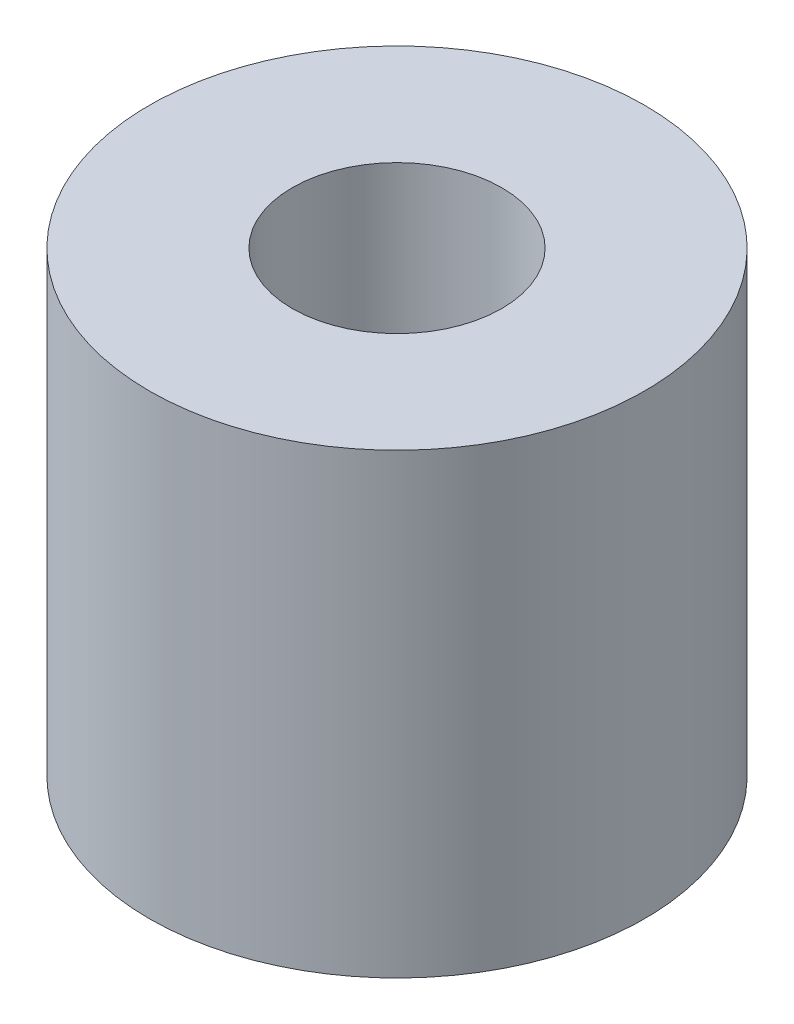
ISO-10303-21;
HEADER;
FILE_DESCRIPTION(('STEP AP214'),'2;1');
FILE_NAME('part.step','',(''),(''),'','','');
FILE_SCHEMA(('AUTOMOTIVE_DESIGN { 1 0 10303 214 1 1 1 1 }'));
ENDSEC;
DATA;
#1=APPLICATION_CONTEXT('core data for automotive mechanical design processes');
#2=APPLICATION_PROTOCOL_DEFINITION('international standard','automotive_design',2000,#1);
#3=PRODUCT_CONTEXT('',#1,'mechanical');
#4=PRODUCT('Part','Part','',(#3));
#5=PRODUCT_RELATED_PRODUCT_CATEGORY('part','',(#4));
#6=PRODUCT_DEFINITION_FORMATION('','',#4);
#7=PRODUCT_DEFINITION_CONTEXT('part definition',#1,'design');
#8=PRODUCT_DEFINITION('design','',#6,#7);
#9=PRODUCT_DEFINITION_SHAPE('','',#8);
#10=(LENGTH_UNIT() NAMED_UNIT(*) SI_UNIT(.MILLI.,.METRE.));
#11=(NAMED_UNIT(*) PLANE_ANGLE_UNIT() SI_UNIT($,.RADIAN.));
#12=(NAMED_UNIT(*) SI_UNIT($,.STERADIAN.) SOLID_ANGLE_UNIT());
#13=UNCERTAINTY_MEASURE_WITH_UNIT(LENGTH_MEASURE(1.E-05),#10,'distance_accuracy_value','');
#14=(GEOMETRIC_REPRESENTATION_CONTEXT(3) GLOBAL_UNCERTAINTY_ASSIGNED_CONTEXT((#13)) GLOBAL_UNIT_ASSIGNED_CONTEXT((#10,
#11,#12)) REPRESENTATION_CONTEXT('',''));
#15=CARTESIAN_POINT('',(0.,0.,0.));
#16=DIRECTION('',(0.,0.,1.));
#17=DIRECTION('',(1.,0.,0.));
#18=AXIS2_PLACEMENT_3D('',#15,#16,#17);
#19=CARTESIAN_POINT('',(0.,7.2,0.));
#20=DIRECTION('',(0.,1.,0.));
#21=DIRECTION('',(0.,0.,1.));
#22=AXIS2_PLACEMENT_3D('',#19,#20,#21);
#23=PLANE('',#22);
#24=CARTESIAN_POINT('',(0.,7.2,0.));
#25=DIRECTION('',(0.,1.,0.));
#26=DIRECTION('',(0.,0.,1.));
#27=AXIS2_PLACEMENT_3D('',#24,#25,#26);
#28=CIRCLE('',#27,3.9);
#29=CARTESIAN_POINT('',(0.,7.2,3.9));
#30=VERTEX_POINT('',#29);
#31=EDGE_CURVE('E10',#30,#30,#28,.T.);
#32=ORIENTED_EDGE('',*,*,#31,.T.);
#33=EDGE_LOOP('',(#32));
#34=FACE_BOUND('',#33,.T.);
#35=CARTESIAN_POINT('',(0.,7.2,0.));
#36=DIRECTION('',(0.,1.,0.));
#37=DIRECTION('',(0.,0.,1.));
#38=AXIS2_PLACEMENT_3D('',#35,#36,#37);
#39=CIRCLE('',#38,1.65);
#40=CARTESIAN_POINT('',(0.,7.2,1.65));
#41=VERTEX_POINT('',#40);
#42=EDGE_CURVE('E46',#41,#41,#39,.T.);
#43=ORIENTED_EDGE('',*,*,#42,.F.);
#44=EDGE_LOOP('',(#43));
#45=FACE_BOUND('',#44,.T.);
#46=ADVANCED_FACE('F35',(#34,#45),#23,.T.);
#47=CARTESIAN_POINT('',(0.,0.,0.));
#48=DIRECTION('',(0.,1.,0.));
#49=DIRECTION('',(0.,0.,1.));
#50=AXIS2_PLACEMENT_3D('',#47,#48,#49);
#51=PLANE('',#50);
#52=CARTESIAN_POINT('',(0.,0.,0.));
#53=DIRECTION('',(0.,1.,0.));
#54=DIRECTION('',(0.,0.,1.));
#55=AXIS2_PLACEMENT_3D('',#52,#53,#54);
#56=CIRCLE('',#55,3.9);
#57=CARTESIAN_POINT('',(0.,0.,3.9));
#58=VERTEX_POINT('',#57);
#59=EDGE_CURVE('E39',#58,#58,#56,.T.);
#60=ORIENTED_EDGE('',*,*,#59,.F.);
#61=EDGE_LOOP('',(#60));
#62=FACE_BOUND('',#61,.T.);
#63=CARTESIAN_POINT('',(0.,0.,0.));
#64=DIRECTION('',(0.,1.,0.));
#65=DIRECTION('',(0.,0.,1.));
#66=AXIS2_PLACEMENT_3D('',#63,#64,#65);
#67=CIRCLE('',#66,1.65);
#68=CARTESIAN_POINT('',(0.,0.,1.65));
#69=VERTEX_POINT('',#68);
#70=EDGE_CURVE('E48',#69,#69,#67,.T.);
#71=ORIENTED_EDGE('',*,*,#70,.T.);
#72=EDGE_LOOP('',(#71));
#73=FACE_BOUND('',#72,.T.);
#74=ADVANCED_FACE('F58',(#62,#73),#51,.F.);
#75=CARTESIAN_POINT('',(0.,7.2,0.));
#76=DIRECTION('',(0.,-1.,0.));
#77=DIRECTION('',(0.,0.,-1.));
#78=AXIS2_PLACEMENT_3D('',#75,#76,#77);
#79=CYLINDRICAL_SURFACE('',#78,3.9);
#80=ORIENTED_EDGE('',*,*,#31,.F.);
#81=EDGE_LOOP('',(#80));
#82=FACE_BOUND('',#81,.T.);
#83=ORIENTED_EDGE('',*,*,#59,.T.);
#84=EDGE_LOOP('',(#83));
#85=FACE_BOUND('',#84,.T.);
#86=ADVANCED_FACE('F37',(#82,#85),#79,.T.);
#87=CARTESIAN_POINT('',(0.,7.2,0.));
#88=DIRECTION('',(0.,-1.,0.));
#89=DIRECTION('',(0.,0.,-1.));
#90=AXIS2_PLACEMENT_3D('',#87,#88,#89);
#91=CYLINDRICAL_SURFACE('',#90,1.65);
#92=ORIENTED_EDGE('',*,*,#42,.T.);
#93=EDGE_LOOP('',(#92));
#94=FACE_BOUND('',#93,.T.);
#95=ORIENTED_EDGE('',*,*,#70,.F.);
#96=EDGE_LOOP('',(#95));
#97=FACE_BOUND('',#96,.T.);
#98=ADVANCED_FACE('F54',(#94,#97),#91,.F.);
#99=CLOSED_SHELL('',(#46,#74,#86,#98));
#100=MANIFOLD_SOLID_BREP('B2',#99);
#101=ADVANCED_BREP_SHAPE_REPRESENTATION('',(#18,#100),#14);
#102=SHAPE_DEFINITION_REPRESENTATION(#9,#101);
ENDSEC;
END-ISO-10303-21;
